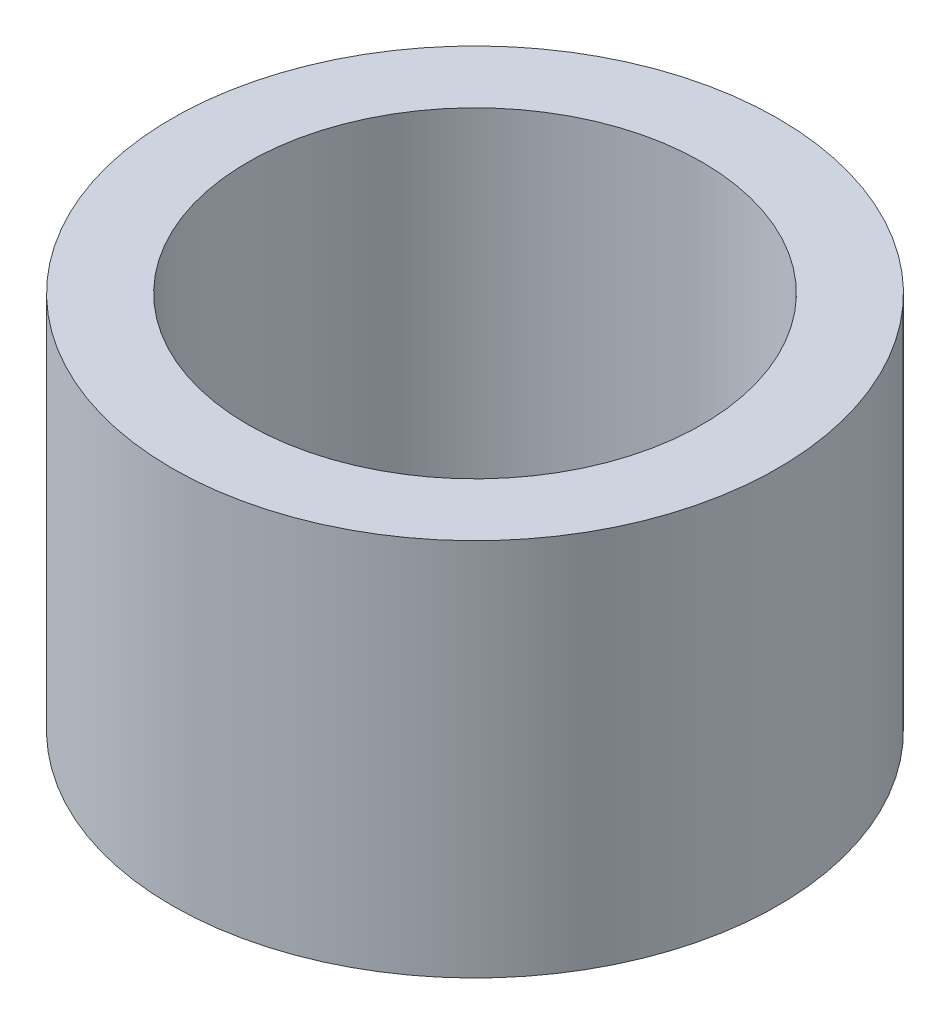
ISO-10303-21;
HEADER;
FILE_DESCRIPTION(('STEP AP214'),'2;1');
FILE_NAME('part.step','',(''),(''),'','','');
FILE_SCHEMA(('AUTOMOTIVE_DESIGN { 1 0 10303 214 1 1 1 1 }'));
ENDSEC;
DATA;
#1=APPLICATION_CONTEXT('core data for automotive mechanical design processes');
#2=APPLICATION_PROTOCOL_DEFINITION('international standard','automotive_design',2000,#1);
#3=PRODUCT_CONTEXT('',#1,'mechanical');
#4=PRODUCT('Part','Part','',(#3));
#5=PRODUCT_RELATED_PRODUCT_CATEGORY('part','',(#4));
#6=PRODUCT_DEFINITION_FORMATION('','',#4);
#7=PRODUCT_DEFINITION_CONTEXT('part definition',#1,'design');
#8=PRODUCT_DEFINITION('design','',#6,#7);
#9=PRODUCT_DEFINITION_SHAPE('','',#8);
#10=(LENGTH_UNIT() NAMED_UNIT(*) SI_UNIT(.MILLI.,.METRE.));
#11=(NAMED_UNIT(*) PLANE_ANGLE_UNIT() SI_UNIT($,.RADIAN.));
#12=(NAMED_UNIT(*) SI_UNIT($,.STERADIAN.) SOLID_ANGLE_UNIT());
#13=UNCERTAINTY_MEASURE_WITH_UNIT(LENGTH_MEASURE(1.E-05),#10,'distance_accuracy_value','');
#14=(GEOMETRIC_REPRESENTATION_CONTEXT(3) GLOBAL_UNCERTAINTY_ASSIGNED_CONTEXT((#13)) GLOBAL_UNIT_ASSIGNED_CONTEXT((#10,
#11,#12)) REPRESENTATION_CONTEXT('',''));
#15=CARTESIAN_POINT('',(0.,0.,0.));
#16=DIRECTION('',(0.,0.,1.));
#17=DIRECTION('',(1.,0.,0.));
#18=AXIS2_PLACEMENT_3D('',#15,#16,#17);
#19=CARTESIAN_POINT('',(0.,5.,0.));
#20=DIRECTION('',(0.,1.,0.));
#21=DIRECTION('',(0.,0.,1.));
#22=AXIS2_PLACEMENT_3D('',#19,#20,#21);
#23=PLANE('',#22);
#24=CARTESIAN_POINT('',(0.,5.,0.));
#25=DIRECTION('',(0.,1.,0.));
#26=DIRECTION('',(0.,0.,1.));
#27=AXIS2_PLACEMENT_3D('',#24,#25,#26);
#28=CIRCLE('',#27,4.);
#29=CARTESIAN_POINT('',(0.,5.,4.));
#30=VERTEX_POINT('',#29);
#31=EDGE_CURVE('E10',#30,#30,#28,.T.);
#32=ORIENTED_EDGE('',*,*,#31,.T.);
#33=EDGE_LOOP('',(#32));
#34=FACE_BOUND('',#33,.T.);
#35=CARTESIAN_POINT('',(0.,5.,0.));
#36=DIRECTION('',(0.,1.,0.));
#37=DIRECTION('',(0.,0.,1.));
#38=AXIS2_PLACEMENT_3D('',#35,#36,#37);
#39=CIRCLE('',#38,3.);
#40=CARTESIAN_POINT('',(0.,5.,3.));
#41=VERTEX_POINT('',#40);
#42=EDGE_CURVE('E42',#41,#41,#39,.T.);
#43=ORIENTED_EDGE('',*,*,#42,.F.);
#44=EDGE_LOOP('',(#43));
#45=FACE_BOUND('',#44,.T.);
#46=ADVANCED_FACE('F31',(#34,#45),#23,.T.);
#47=CARTESIAN_POINT('',(0.,0.,0.));
#48=DIRECTION('',(0.,1.,0.));
#49=DIRECTION('',(0.,0.,1.));
#50=AXIS2_PLACEMENT_3D('',#47,#48,#49);
#51=PLANE('',#50);
#52=CARTESIAN_POINT('',(0.,0.,0.));
#53=DIRECTION('',(0.,1.,0.));
#54=DIRECTION('',(0.,0.,1.));
#55=AXIS2_PLACEMENT_3D('',#52,#53,#54);
#56=CIRCLE('',#55,4.);
#57=CARTESIAN_POINT('',(0.,0.,4.));
#58=VERTEX_POINT('',#57);
#59=EDGE_CURVE('E35',#58,#58,#56,.T.);
#60=ORIENTED_EDGE('',*,*,#59,.F.);
#61=EDGE_LOOP('',(#60));
#62=FACE_BOUND('',#61,.T.);
#63=CARTESIAN_POINT('',(0.,0.,0.));
#64=DIRECTION('',(0.,1.,0.));
#65=DIRECTION('',(0.,0.,1.));
#66=AXIS2_PLACEMENT_3D('',#63,#64,#65);
#67=CIRCLE('',#66,3.);
#68=CARTESIAN_POINT('',(0.,0.,3.));
#69=VERTEX_POINT('',#68);
#70=EDGE_CURVE('E44',#69,#69,#67,.T.);
#71=ORIENTED_EDGE('',*,*,#70,.T.);
#72=EDGE_LOOP('',(#71));
#73=FACE_BOUND('',#72,.T.);
#74=ADVANCED_FACE('F54',(#62,#73),#51,.F.);
#75=CARTESIAN_POINT('',(0.,5.,0.));
#76=DIRECTION('',(0.,-1.,0.));
#77=DIRECTION('',(0.,0.,-1.));
#78=AXIS2_PLACEMENT_3D('',#75,#76,#77);
#79=CYLINDRICAL_SURFACE('',#78,4.);
#80=ORIENTED_EDGE('',*,*,#31,.F.);
#81=EDGE_LOOP('',(#80));
#82=FACE_BOUND('',#81,.T.);
#83=ORIENTED_EDGE('',*,*,#59,.T.);
#84=EDGE_LOOP('',(#83));
#85=FACE_BOUND('',#84,.T.);
#86=ADVANCED_FACE('F33',(#82,#85),#79,.T.);
#87=CARTESIAN_POINT('',(0.,5.,0.));
#88=DIRECTION('',(0.,-1.,0.));
#89=DIRECTION('',(0.,0.,-1.));
#90=AXIS2_PLACEMENT_3D('',#87,#88,#89);
#91=CYLINDRICAL_SURFACE('',#90,3.);
#92=ORIENTED_EDGE('',*,*,#42,.T.);
#93=EDGE_LOOP('',(#92));
#94=FACE_BOUND('',#93,.T.);
#95=ORIENTED_EDGE('',*,*,#70,.F.);
#96=EDGE_LOOP('',(#95));
#97=FACE_BOUND('',#96,.T.);
#98=ADVANCED_FACE('F50',(#94,#97),#91,.F.);
#99=CLOSED_SHELL('',(#46,#74,#86,#98));
#100=MANIFOLD_SOLID_BREP('B2',#99);
#101=ADVANCED_BREP_SHAPE_REPRESENTATION('',(#18,#100),#14);
#102=SHAPE_DEFINITION_REPRESENTATION(#9,#101);
ENDSEC;
END-ISO-10303-21;
